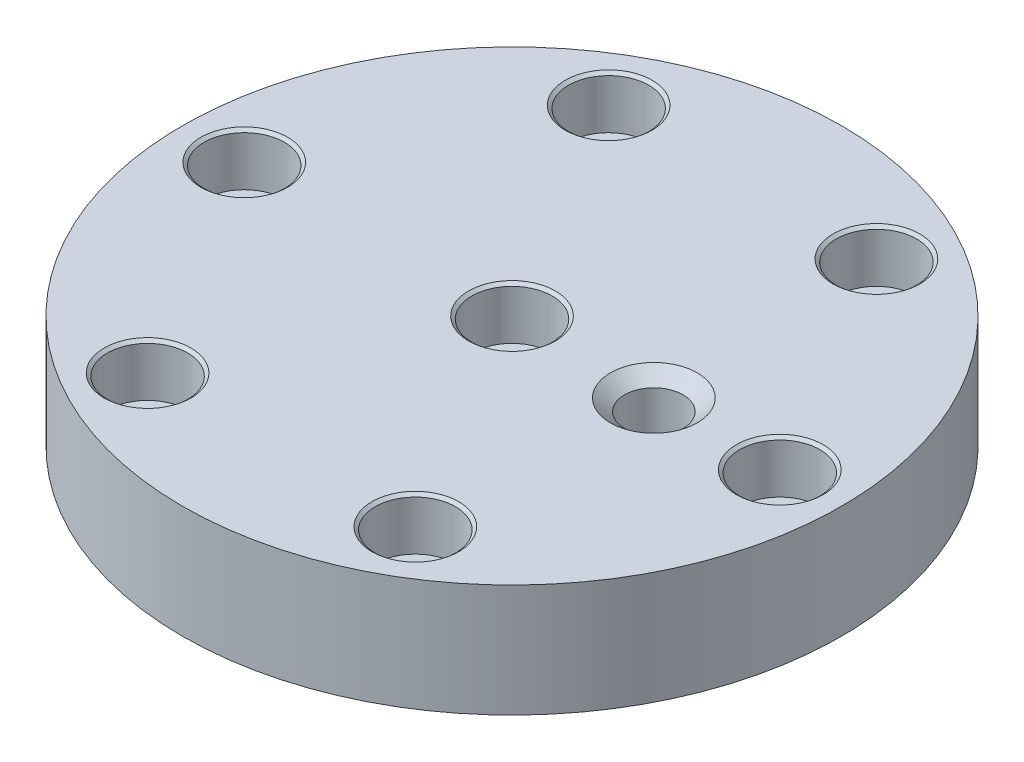
ISO-10303-21;
HEADER;
FILE_DESCRIPTION(('STEP AP214'),'2;1');
FILE_NAME('part.step','',(''),(''),'','','');
FILE_SCHEMA(('AUTOMOTIVE_DESIGN { 1 0 10303 214 1 1 1 1 }'));
ENDSEC;
DATA;
#1=APPLICATION_CONTEXT('core data for automotive mechanical design processes');
#2=APPLICATION_PROTOCOL_DEFINITION('international standard','automotive_design',2000,#1);
#3=PRODUCT_CONTEXT('',#1,'mechanical');
#4=PRODUCT('Part','Part','',(#3));
#5=PRODUCT_RELATED_PRODUCT_CATEGORY('part','',(#4));
#6=PRODUCT_DEFINITION_FORMATION('','',#4);
#7=PRODUCT_DEFINITION_CONTEXT('part definition',#1,'design');
#8=PRODUCT_DEFINITION('design','',#6,#7);
#9=PRODUCT_DEFINITION_SHAPE('','',#8);
#10=(LENGTH_UNIT() NAMED_UNIT(*) SI_UNIT(.MILLI.,.METRE.));
#11=(NAMED_UNIT(*) PLANE_ANGLE_UNIT() SI_UNIT($,.RADIAN.));
#12=(NAMED_UNIT(*) SI_UNIT($,.STERADIAN.) SOLID_ANGLE_UNIT());
#13=UNCERTAINTY_MEASURE_WITH_UNIT(LENGTH_MEASURE(1.E-05),#10,'distance_accuracy_value','');
#14=(GEOMETRIC_REPRESENTATION_CONTEXT(3) GLOBAL_UNCERTAINTY_ASSIGNED_CONTEXT((#13)) GLOBAL_UNIT_ASSIGNED_CONTEXT((#10,
#11,#12)) REPRESENTATION_CONTEXT('',''));
#15=CARTESIAN_POINT('',(0.,0.,0.));
#16=DIRECTION('',(0.,0.,1.));
#17=DIRECTION('',(1.,0.,0.));
#18=AXIS2_PLACEMENT_3D('',#15,#16,#17);
#19=CARTESIAN_POINT('',(0.,27.,0.));
#20=DIRECTION('',(0.,1.,0.));
#21=DIRECTION('',(0.,0.,1.));
#22=AXIS2_PLACEMENT_3D('',#19,#20,#21);
#23=PLANE('',#22);
#24=CARTESIAN_POINT('',(34.,27.,0.));
#25=DIRECTION('',(0.,1.,0.));
#26=DIRECTION('',(0.,0.,1.));
#27=AXIS2_PLACEMENT_3D('',#24,#25,#26);
#28=CIRCLE('',#27,10.4013);
#29=CARTESIAN_POINT('',(34.,27.,10.4013));
#30=VERTEX_POINT('',#29);
#31=EDGE_CURVE('E69',#30,#30,#28,.T.);
#32=ORIENTED_EDGE('',*,*,#31,.F.);
#33=EDGE_LOOP('',(#32));
#34=FACE_BOUND('',#33,.T.);
#35=CARTESIAN_POINT('',(31.8385743820876,27.,-55.518512059639));
#36=DIRECTION('',(0.,1.,0.));
#37=DIRECTION('',(0.,0.,1.));
#38=AXIS2_PLACEMENT_3D('',#35,#36,#37);
#39=CIRCLE('',#38,10.4013);
#40=CARTESIAN_POINT('',(31.8385743820876,27.,-45.117212059639));
#41=VERTEX_POINT('',#40);
#42=EDGE_CURVE('E60',#41,#41,#39,.T.);
#43=ORIENTED_EDGE('',*,*,#42,.F.);
#44=EDGE_LOOP('',(#43));
#45=FACE_BOUND('',#44,.T.);
#46=CARTESIAN_POINT('',(63.9997290150054,27.,-0.186241794652134));
#47=DIRECTION('',(0.,1.,0.));
#48=DIRECTION('',(0.,0.,1.));
#49=AXIS2_PLACEMENT_3D('',#46,#47,#48);
#50=CIRCLE('',#49,10.4013);
#51=CARTESIAN_POINT('',(63.9997290150054,27.,10.2150582053479));
#52=VERTEX_POINT('',#51);
#53=EDGE_CURVE('E88',#52,#52,#50,.T.);
#54=ORIENTED_EDGE('',*,*,#53,.F.);
#55=EDGE_LOOP('',(#54));
#56=FACE_BOUND('',#55,.T.);
#57=CARTESIAN_POINT('',(32.1611546329195,27.,55.3322702649877));
#58=DIRECTION('',(0.,1.,0.));
#59=DIRECTION('',(0.,0.,1.));
#60=AXIS2_PLACEMENT_3D('',#57,#58,#59);
#61=CIRCLE('',#60,10.4013);
#62=CARTESIAN_POINT('',(32.1611546329195,27.,65.7335702649877));
#63=VERTEX_POINT('',#62);
#64=EDGE_CURVE('E108',#63,#63,#61,.T.);
#65=ORIENTED_EDGE('',*,*,#64,.F.);
#66=EDGE_LOOP('',(#65));
#67=FACE_BOUND('',#66,.T.);
#68=CARTESIAN_POINT('',(-31.8385743820844,27.,55.5185120596408));
#69=DIRECTION('',(0.,1.,0.));
#70=DIRECTION('',(0.,0.,1.));
#71=AXIS2_PLACEMENT_3D('',#68,#69,#70);
#72=CIRCLE('',#71,10.4013);
#73=CARTESIAN_POINT('',(-31.8385743820844,27.,65.9198120596408));
#74=VERTEX_POINT('',#73);
#75=EDGE_CURVE('E128',#74,#74,#72,.T.);
#76=ORIENTED_EDGE('',*,*,#75,.F.);
#77=EDGE_LOOP('',(#76));
#78=FACE_BOUND('',#77,.T.);
#79=CARTESIAN_POINT('',(-63.9997290150023,27.,0.186241794653986));
#80=DIRECTION('',(0.,1.,0.));
#81=DIRECTION('',(0.,0.,1.));
#82=AXIS2_PLACEMENT_3D('',#79,#80,#81);
#83=CIRCLE('',#82,10.4013);
#84=CARTESIAN_POINT('',(-63.9997290150023,27.,10.587541794654));
#85=VERTEX_POINT('',#84);
#86=EDGE_CURVE('E148',#85,#85,#83,.T.);
#87=ORIENTED_EDGE('',*,*,#86,.F.);
#88=EDGE_LOOP('',(#87));
#89=FACE_BOUND('',#88,.T.);
#90=CARTESIAN_POINT('',(-32.1611546329163,27.,-55.3322702649859));
#91=DIRECTION('',(0.,1.,0.));
#92=DIRECTION('',(0.,0.,1.));
#93=AXIS2_PLACEMENT_3D('',#90,#91,#92);
#94=CIRCLE('',#93,10.4013);
#95=CARTESIAN_POINT('',(-32.1611546329163,27.,-44.9309702649859));
#96=VERTEX_POINT('',#95);
#97=EDGE_CURVE('E168',#96,#96,#94,.T.);
#98=ORIENTED_EDGE('',*,*,#97,.F.);
#99=EDGE_LOOP('',(#98));
#100=FACE_BOUND('',#99,.T.);
#101=CARTESIAN_POINT('',(1.59594559789866E-12,27.,9.15933995315754E-13));
#102=DIRECTION('',(0.,1.,0.));
#103=DIRECTION('',(0.,0.,1.));
#104=AXIS2_PLACEMENT_3D('',#101,#102,#103);
#105=CIRCLE('',#104,10.4013);
#106=CARTESIAN_POINT('',(1.59594559789866E-12,27.,10.4013000000009));
#107=VERTEX_POINT('',#106);
#108=EDGE_CURVE('E188',#107,#107,#105,.T.);
#109=ORIENTED_EDGE('',*,*,#108,.F.);
#110=EDGE_LOOP('',(#109));
#111=FACE_BOUND('',#110,.T.);
#112=CARTESIAN_POINT('',(0.,27.,0.));
#113=DIRECTION('',(0.,1.,0.));
#114=DIRECTION('',(0.,0.,1.));
#115=AXIS2_PLACEMENT_3D('',#112,#113,#114);
#116=CIRCLE('',#115,79.);
#117=CARTESIAN_POINT('',(0.,27.,79.));
#118=VERTEX_POINT('',#117);
#119=EDGE_CURVE('E11',#118,#118,#116,.T.);
#120=ORIENTED_EDGE('',*,*,#119,.T.);
#121=EDGE_LOOP('',(#120));
#122=FACE_BOUND('',#121,.T.);
#123=ADVANCED_FACE('F38',(#34,#45,#56,#67,#78,#89,#100,#111,#122),#23,.T.);
#124=CARTESIAN_POINT('',(0.,0.,0.));
#125=DIRECTION('',(0.,1.,0.));
#126=DIRECTION('',(0.,0.,1.));
#127=AXIS2_PLACEMENT_3D('',#124,#125,#126);
#128=PLANE('',#127);
#129=CARTESIAN_POINT('',(31.8385743820876,0.,-55.518512059639));
#130=DIRECTION('',(0.,1.,0.));
#131=DIRECTION('',(0.,0.,1.));
#132=AXIS2_PLACEMENT_3D('',#129,#130,#131);
#133=CIRCLE('',#132,6.24999994599999);
#134=CARTESIAN_POINT('',(31.8385743820876,0.,-49.268512113639));
#135=VERTEX_POINT('',#134);
#136=EDGE_CURVE('E84',#135,#135,#133,.T.);
#137=ORIENTED_EDGE('',*,*,#136,.T.);
#138=EDGE_LOOP('',(#137));
#139=FACE_BOUND('',#138,.T.);
#140=CARTESIAN_POINT('',(63.9997290150054,0.,-0.186241794652134));
#141=DIRECTION('',(0.,1.,0.));
#142=DIRECTION('',(0.,0.,1.));
#143=AXIS2_PLACEMENT_3D('',#140,#141,#142);
#144=CIRCLE('',#143,6.24999994599999);
#145=CARTESIAN_POINT('',(63.9997290150054,0.,6.06375815134786));
#146=VERTEX_POINT('',#145);
#147=EDGE_CURVE('E104',#146,#146,#144,.T.);
#148=ORIENTED_EDGE('',*,*,#147,.T.);
#149=EDGE_LOOP('',(#148));
#150=FACE_BOUND('',#149,.T.);
#151=CARTESIAN_POINT('',(32.1611546329195,0.,55.3322702649877));
#152=DIRECTION('',(0.,1.,0.));
#153=DIRECTION('',(0.,0.,1.));
#154=AXIS2_PLACEMENT_3D('',#151,#152,#153);
#155=CIRCLE('',#154,6.24999994599999);
#156=CARTESIAN_POINT('',(32.1611546329195,0.,61.5822702109877));
#157=VERTEX_POINT('',#156);
#158=EDGE_CURVE('E124',#157,#157,#155,.T.);
#159=ORIENTED_EDGE('',*,*,#158,.T.);
#160=EDGE_LOOP('',(#159));
#161=FACE_BOUND('',#160,.T.);
#162=CARTESIAN_POINT('',(-31.8385743820844,0.,55.5185120596408));
#163=DIRECTION('',(0.,1.,0.));
#164=DIRECTION('',(0.,0.,1.));
#165=AXIS2_PLACEMENT_3D('',#162,#163,#164);
#166=CIRCLE('',#165,6.24999994599999);
#167=CARTESIAN_POINT('',(-31.8385743820844,0.,61.7685120056408));
#168=VERTEX_POINT('',#167);
#169=EDGE_CURVE('E144',#168,#168,#166,.T.);
#170=ORIENTED_EDGE('',*,*,#169,.T.);
#171=EDGE_LOOP('',(#170));
#172=FACE_BOUND('',#171,.T.);
#173=CARTESIAN_POINT('',(-63.9997290150023,0.,0.186241794653986));
#174=DIRECTION('',(0.,1.,0.));
#175=DIRECTION('',(0.,0.,1.));
#176=AXIS2_PLACEMENT_3D('',#173,#174,#175);
#177=CIRCLE('',#176,6.24999994599999);
#178=CARTESIAN_POINT('',(-63.9997290150023,0.,6.43624174065398));
#179=VERTEX_POINT('',#178);
#180=EDGE_CURVE('E164',#179,#179,#177,.T.);
#181=ORIENTED_EDGE('',*,*,#180,.T.);
#182=EDGE_LOOP('',(#181));
#183=FACE_BOUND('',#182,.T.);
#184=CARTESIAN_POINT('',(-32.1611546329163,0.,-55.3322702649859));
#185=DIRECTION('',(0.,1.,0.));
#186=DIRECTION('',(0.,0.,1.));
#187=AXIS2_PLACEMENT_3D('',#184,#185,#186);
#188=CIRCLE('',#187,6.24999994599999);
#189=CARTESIAN_POINT('',(-32.1611546329163,0.,-49.0822703189859));
#190=VERTEX_POINT('',#189);
#191=EDGE_CURVE('E184',#190,#190,#188,.T.);
#192=ORIENTED_EDGE('',*,*,#191,.T.);
#193=EDGE_LOOP('',(#192));
#194=FACE_BOUND('',#193,.T.);
#195=CARTESIAN_POINT('',(1.59594559789866E-12,0.,9.15933995315754E-13));
#196=DIRECTION('',(0.,1.,0.));
#197=DIRECTION('',(0.,0.,1.));
#198=AXIS2_PLACEMENT_3D('',#195,#196,#197);
#199=CIRCLE('',#198,6.24999994599999);
#200=CARTESIAN_POINT('',(1.59594559789866E-12,0.,6.24999994600091));
#201=VERTEX_POINT('',#200);
#202=EDGE_CURVE('E204',#201,#201,#199,.T.);
#203=ORIENTED_EDGE('',*,*,#202,.T.);
#204=EDGE_LOOP('',(#203));
#205=FACE_BOUND('',#204,.T.);
#206=CARTESIAN_POINT('',(0.,0.,0.));
#207=DIRECTION('',(0.,1.,0.));
#208=DIRECTION('',(0.,0.,1.));
#209=AXIS2_PLACEMENT_3D('',#206,#207,#208);
#210=CIRCLE('',#209,79.);
#211=CARTESIAN_POINT('',(0.,0.,79.));
#212=VERTEX_POINT('',#211);
#213=EDGE_CURVE('E42',#212,#212,#210,.T.);
#214=ORIENTED_EDGE('',*,*,#213,.F.);
#215=EDGE_LOOP('',(#214));
#216=FACE_BOUND('',#215,.T.);
#217=ADVANCED_FACE('F214',(#139,#150,#161,#172,#183,#194,#205,#216),#128,.F.);
#218=CARTESIAN_POINT('',(0.,27.,0.));
#219=DIRECTION('',(0.,-1.,0.));
#220=DIRECTION('',(0.,0.,-1.));
#221=AXIS2_PLACEMENT_3D('',#218,#219,#220);
#222=CYLINDRICAL_SURFACE('',#221,79.);
#223=ORIENTED_EDGE('',*,*,#119,.F.);
#224=EDGE_LOOP('',(#223));
#225=FACE_BOUND('',#224,.T.);
#226=ORIENTED_EDGE('',*,*,#213,.T.);
#227=EDGE_LOOP('',(#226));
#228=FACE_BOUND('',#227,.T.);
#229=ADVANCED_FACE('F40',(#225,#228),#222,.T.);
#230=CARTESIAN_POINT('',(1.59594559789866E-12,27.,9.15933995315754E-13));
#231=DIRECTION('',(0.,1.,0.));
#232=DIRECTION('',(0.,0.,1.));
#233=AXIS2_PLACEMENT_3D('',#230,#231,#232);
#234=CYLINDRICAL_SURFACE('',#233,6.24999994599999);
#235=ORIENTED_EDGE('',*,*,#202,.F.);
#236=EDGE_LOOP('',(#235));
#237=FACE_BOUND('',#236,.T.);
#238=CARTESIAN_POINT('',(1.59594559789866E-12,14.500000108,9.15933995315754E-13));
#239=DIRECTION('',(0.,1.,0.));
#240=DIRECTION('',(0.,0.,1.));
#241=AXIS2_PLACEMENT_3D('',#238,#239,#240);
#242=CIRCLE('',#241,6.249999946);
#243=CARTESIAN_POINT('',(1.59594559789866E-12,14.500000108,6.24999994600091));
#244=VERTEX_POINT('',#243);
#245=EDGE_CURVE('E200',#244,#244,#242,.T.);
#246=ORIENTED_EDGE('',*,*,#245,.T.);
#247=EDGE_LOOP('',(#246));
#248=FACE_BOUND('',#247,.T.);
#249=ADVANCED_FACE('F221',(#237,#248),#234,.F.);
#250=CARTESIAN_POINT('',(9.62500005400159,14.500000108,9.15933995315754E-13));
#251=DIRECTION('',(0.,-1.,0.));
#252=DIRECTION('',(0.,0.,-1.));
#253=AXIS2_PLACEMENT_3D('',#250,#251,#252);
#254=PLANE('',#253);
#255=ORIENTED_EDGE('',*,*,#245,.F.);
#256=EDGE_LOOP('',(#255));
#257=FACE_BOUND('',#256,.T.);
#258=CARTESIAN_POINT('',(1.59594559789866E-12,14.500000108,9.15933995315754E-13));
#259=DIRECTION('',(0.,1.,0.));
#260=DIRECTION('',(0.,0.,1.));
#261=AXIS2_PLACEMENT_3D('',#258,#259,#260);
#262=CIRCLE('',#261,9.625000054);
#263=CARTESIAN_POINT('',(1.59594559789866E-12,14.500000108,9.62500005400091));
#264=VERTEX_POINT('',#263);
#265=EDGE_CURVE('E196',#264,#264,#262,.T.);
#266=ORIENTED_EDGE('',*,*,#265,.T.);
#267=EDGE_LOOP('',(#266));
#268=FACE_BOUND('',#267,.T.);
#269=ADVANCED_FACE('F229',(#257,#268),#254,.F.);
#270=CARTESIAN_POINT('',(1.59594559789866E-12,27.,9.15933995315754E-13));
#271=DIRECTION('',(0.,1.,0.));
#272=DIRECTION('',(0.,0.,1.));
#273=AXIS2_PLACEMENT_3D('',#270,#271,#272);
#274=CYLINDRICAL_SURFACE('',#273,9.625000054);
#275=ORIENTED_EDGE('',*,*,#265,.F.);
#276=EDGE_LOOP('',(#275));
#277=FACE_BOUND('',#276,.T.);
#278=CARTESIAN_POINT('',(1.59594559789866E-12,26.3486070016285,9.15933995315754E-13));
#279=DIRECTION('',(0.,1.,0.));
#280=DIRECTION('',(0.,0.,1.));
#281=AXIS2_PLACEMENT_3D('',#278,#279,#280);
#282=CIRCLE('',#281,9.625000054);
#283=CARTESIAN_POINT('',(1.59594559789866E-12,26.3486070016285,9.62500005400091));
#284=VERTEX_POINT('',#283);
#285=EDGE_CURVE('E192',#284,#284,#282,.T.);
#286=ORIENTED_EDGE('',*,*,#285,.T.);
#287=EDGE_LOOP('',(#286));
#288=FACE_BOUND('',#287,.T.);
#289=ADVANCED_FACE('F233',(#277,#288),#274,.F.);
#290=CARTESIAN_POINT('',(1.59594559789866E-12,27.,9.15933995315754E-13));
#291=DIRECTION('',(0.,1.,0.));
#292=DIRECTION('',(0.,0.,1.));
#293=AXIS2_PLACEMENT_3D('',#290,#291,#292);
#294=CONICAL_SURFACE('',#293,10.4013,0.872664625997165);
#295=ORIENTED_EDGE('',*,*,#285,.F.);
#296=EDGE_LOOP('',(#295));
#297=FACE_BOUND('',#296,.T.);
#298=ORIENTED_EDGE('',*,*,#108,.T.);
#299=EDGE_LOOP('',(#298));
#300=FACE_BOUND('',#299,.T.);
#301=ADVANCED_FACE('F237',(#297,#300),#294,.F.);
#302=CARTESIAN_POINT('',(-32.1611546329163,27.,-55.3322702649859));
#303=DIRECTION('',(0.,1.,0.));
#304=DIRECTION('',(0.,0.,1.));
#305=AXIS2_PLACEMENT_3D('',#302,#303,#304);
#306=CYLINDRICAL_SURFACE('',#305,6.24999994599999);
#307=ORIENTED_EDGE('',*,*,#191,.F.);
#308=EDGE_LOOP('',(#307));
#309=FACE_BOUND('',#308,.T.);
#310=CARTESIAN_POINT('',(-32.1611546329163,14.500000108,-55.3322702649859));
#311=DIRECTION('',(0.,1.,0.));
#312=DIRECTION('',(0.,0.,1.));
#313=AXIS2_PLACEMENT_3D('',#310,#311,#312);
#314=CIRCLE('',#313,6.249999946);
#315=CARTESIAN_POINT('',(-32.1611546329163,14.500000108,-49.0822703189859));
#316=VERTEX_POINT('',#315);
#317=EDGE_CURVE('E180',#316,#316,#314,.T.);
#318=ORIENTED_EDGE('',*,*,#317,.T.);
#319=EDGE_LOOP('',(#318));
#320=FACE_BOUND('',#319,.T.);
#321=ADVANCED_FACE('F241',(#309,#320),#306,.F.);
#322=CARTESIAN_POINT('',(-22.5361545789163,14.500000108,-55.3322702649859));
#323=DIRECTION('',(0.,-1.,0.));
#324=DIRECTION('',(0.,0.,-1.));
#325=AXIS2_PLACEMENT_3D('',#322,#323,#324);
#326=PLANE('',#325);
#327=ORIENTED_EDGE('',*,*,#317,.F.);
#328=EDGE_LOOP('',(#327));
#329=FACE_BOUND('',#328,.T.);
#330=CARTESIAN_POINT('',(-32.1611546329163,14.500000108,-55.3322702649859));
#331=DIRECTION('',(0.,1.,0.));
#332=DIRECTION('',(0.,0.,1.));
#333=AXIS2_PLACEMENT_3D('',#330,#331,#332);
#334=CIRCLE('',#333,9.62500005399999);
#335=CARTESIAN_POINT('',(-32.1611546329163,14.500000108,-45.7072702109859));
#336=VERTEX_POINT('',#335);
#337=EDGE_CURVE('E176',#336,#336,#334,.T.);
#338=ORIENTED_EDGE('',*,*,#337,.T.);
#339=EDGE_LOOP('',(#338));
#340=FACE_BOUND('',#339,.T.);
#341=ADVANCED_FACE('F245',(#329,#340),#326,.F.);
#342=CARTESIAN_POINT('',(-32.1611546329163,27.,-55.3322702649859));
#343=DIRECTION('',(0.,1.,0.));
#344=DIRECTION('',(0.,0.,1.));
#345=AXIS2_PLACEMENT_3D('',#342,#343,#344);
#346=CYLINDRICAL_SURFACE('',#345,9.625000054);
#347=ORIENTED_EDGE('',*,*,#337,.F.);
#348=EDGE_LOOP('',(#347));
#349=FACE_BOUND('',#348,.T.);
#350=CARTESIAN_POINT('',(-32.1611546329163,26.3486070016285,-55.3322702649859));
#351=DIRECTION('',(0.,1.,0.));
#352=DIRECTION('',(0.,0.,1.));
#353=AXIS2_PLACEMENT_3D('',#350,#351,#352);
#354=CIRCLE('',#353,9.625000054);
#355=CARTESIAN_POINT('',(-32.1611546329163,26.3486070016285,-45.7072702109859));
#356=VERTEX_POINT('',#355);
#357=EDGE_CURVE('E172',#356,#356,#354,.T.);
#358=ORIENTED_EDGE('',*,*,#357,.T.);
#359=EDGE_LOOP('',(#358));
#360=FACE_BOUND('',#359,.T.);
#361=ADVANCED_FACE('F249',(#349,#360),#346,.F.);
#362=CARTESIAN_POINT('',(-32.1611546329163,27.,-55.3322702649859));
#363=DIRECTION('',(0.,1.,0.));
#364=DIRECTION('',(0.,0.,1.));
#365=AXIS2_PLACEMENT_3D('',#362,#363,#364);
#366=CONICAL_SURFACE('',#365,10.4013,0.872664625997164);
#367=ORIENTED_EDGE('',*,*,#357,.F.);
#368=EDGE_LOOP('',(#367));
#369=FACE_BOUND('',#368,.T.);
#370=ORIENTED_EDGE('',*,*,#97,.T.);
#371=EDGE_LOOP('',(#370));
#372=FACE_BOUND('',#371,.T.);
#373=ADVANCED_FACE('F253',(#369,#372),#366,.F.);
#374=CARTESIAN_POINT('',(-63.9997290150023,27.,0.186241794653986));
#375=DIRECTION('',(0.,1.,0.));
#376=DIRECTION('',(0.,0.,1.));
#377=AXIS2_PLACEMENT_3D('',#374,#375,#376);
#378=CYLINDRICAL_SURFACE('',#377,6.24999994599999);
#379=ORIENTED_EDGE('',*,*,#180,.F.);
#380=EDGE_LOOP('',(#379));
#381=FACE_BOUND('',#380,.T.);
#382=CARTESIAN_POINT('',(-63.9997290150023,14.500000108,0.186241794653986));
#383=DIRECTION('',(0.,1.,0.));
#384=DIRECTION('',(0.,0.,1.));
#385=AXIS2_PLACEMENT_3D('',#382,#383,#384);
#386=CIRCLE('',#385,6.24999994599999);
#387=CARTESIAN_POINT('',(-63.9997290150023,14.500000108,6.43624174065398));
#388=VERTEX_POINT('',#387);
#389=EDGE_CURVE('E160',#388,#388,#386,.T.);
#390=ORIENTED_EDGE('',*,*,#389,.T.);
#391=EDGE_LOOP('',(#390));
#392=FACE_BOUND('',#391,.T.);
#393=ADVANCED_FACE('F257',(#381,#392),#378,.F.);
#394=CARTESIAN_POINT('',(-54.3747289610023,14.500000108,0.186241794653986));
#395=DIRECTION('',(0.,-1.,0.));
#396=DIRECTION('',(0.,0.,-1.));
#397=AXIS2_PLACEMENT_3D('',#394,#395,#396);
#398=PLANE('',#397);
#399=ORIENTED_EDGE('',*,*,#389,.F.);
#400=EDGE_LOOP('',(#399));
#401=FACE_BOUND('',#400,.T.);
#402=CARTESIAN_POINT('',(-63.9997290150023,14.500000108,0.186241794653986));
#403=DIRECTION('',(0.,1.,0.));
#404=DIRECTION('',(0.,0.,1.));
#405=AXIS2_PLACEMENT_3D('',#402,#403,#404);
#406=CIRCLE('',#405,9.62500005399999);
#407=CARTESIAN_POINT('',(-63.9997290150023,14.500000108,9.81124184865398));
#408=VERTEX_POINT('',#407);
#409=EDGE_CURVE('E156',#408,#408,#406,.T.);
#410=ORIENTED_EDGE('',*,*,#409,.T.);
#411=EDGE_LOOP('',(#410));
#412=FACE_BOUND('',#411,.T.);
#413=ADVANCED_FACE('F261',(#401,#412),#398,.F.);
#414=CARTESIAN_POINT('',(-63.9997290150023,27.,0.186241794653986));
#415=DIRECTION('',(0.,1.,0.));
#416=DIRECTION('',(0.,0.,1.));
#417=AXIS2_PLACEMENT_3D('',#414,#415,#416);
#418=CYLINDRICAL_SURFACE('',#417,9.625000054);
#419=ORIENTED_EDGE('',*,*,#409,.F.);
#420=EDGE_LOOP('',(#419));
#421=FACE_BOUND('',#420,.T.);
#422=CARTESIAN_POINT('',(-63.9997290150023,26.3486070016285,0.186241794653986));
#423=DIRECTION('',(0.,1.,0.));
#424=DIRECTION('',(0.,0.,1.));
#425=AXIS2_PLACEMENT_3D('',#422,#423,#424);
#426=CIRCLE('',#425,9.625000054);
#427=CARTESIAN_POINT('',(-63.9997290150023,26.3486070016285,9.81124184865399));
#428=VERTEX_POINT('',#427);
#429=EDGE_CURVE('E152',#428,#428,#426,.T.);
#430=ORIENTED_EDGE('',*,*,#429,.T.);
#431=EDGE_LOOP('',(#430));
#432=FACE_BOUND('',#431,.T.);
#433=ADVANCED_FACE('F265',(#421,#432),#418,.F.);
#434=CARTESIAN_POINT('',(-63.9997290150023,27.,0.186241794653986));
#435=DIRECTION('',(0.,1.,0.));
#436=DIRECTION('',(0.,0.,1.));
#437=AXIS2_PLACEMENT_3D('',#434,#435,#436);
#438=CONICAL_SURFACE('',#437,10.4013,0.872664625997166);
#439=ORIENTED_EDGE('',*,*,#429,.F.);
#440=EDGE_LOOP('',(#439));
#441=FACE_BOUND('',#440,.T.);
#442=ORIENTED_EDGE('',*,*,#86,.T.);
#443=EDGE_LOOP('',(#442));
#444=FACE_BOUND('',#443,.T.);
#445=ADVANCED_FACE('F269',(#441,#444),#438,.F.);
#446=CARTESIAN_POINT('',(-31.8385743820844,27.,55.5185120596408));
#447=DIRECTION('',(0.,1.,0.));
#448=DIRECTION('',(0.,0.,1.));
#449=AXIS2_PLACEMENT_3D('',#446,#447,#448);
#450=CYLINDRICAL_SURFACE('',#449,6.24999994599999);
#451=ORIENTED_EDGE('',*,*,#169,.F.);
#452=EDGE_LOOP('',(#451));
#453=FACE_BOUND('',#452,.T.);
#454=CARTESIAN_POINT('',(-31.8385743820844,14.500000108,55.5185120596408));
#455=DIRECTION('',(0.,1.,0.));
#456=DIRECTION('',(0.,0.,1.));
#457=AXIS2_PLACEMENT_3D('',#454,#455,#456);
#458=CIRCLE('',#457,6.249999946);
#459=CARTESIAN_POINT('',(-31.8385743820844,14.500000108,61.7685120056408));
#460=VERTEX_POINT('',#459);
#461=EDGE_CURVE('E140',#460,#460,#458,.T.);
#462=ORIENTED_EDGE('',*,*,#461,.T.);
#463=EDGE_LOOP('',(#462));
#464=FACE_BOUND('',#463,.T.);
#465=ADVANCED_FACE('F273',(#453,#464),#450,.F.);
#466=CARTESIAN_POINT('',(-22.2135743280844,14.500000108,55.5185120596408));
#467=DIRECTION('',(0.,-1.,0.));
#468=DIRECTION('',(0.,0.,-1.));
#469=AXIS2_PLACEMENT_3D('',#466,#467,#468);
#470=PLANE('',#469);
#471=ORIENTED_EDGE('',*,*,#461,.F.);
#472=EDGE_LOOP('',(#471));
#473=FACE_BOUND('',#472,.T.);
#474=CARTESIAN_POINT('',(-31.8385743820844,14.500000108,55.5185120596408));
#475=DIRECTION('',(0.,1.,0.));
#476=DIRECTION('',(0.,0.,1.));
#477=AXIS2_PLACEMENT_3D('',#474,#475,#476);
#478=CIRCLE('',#477,9.62500005399999);
#479=CARTESIAN_POINT('',(-31.8385743820844,14.500000108,65.1435121136408));
#480=VERTEX_POINT('',#479);
#481=EDGE_CURVE('E136',#480,#480,#478,.T.);
#482=ORIENTED_EDGE('',*,*,#481,.T.);
#483=EDGE_LOOP('',(#482));
#484=FACE_BOUND('',#483,.T.);
#485=ADVANCED_FACE('F277',(#473,#484),#470,.F.);
#486=CARTESIAN_POINT('',(-31.8385743820844,27.,55.5185120596408));
#487=DIRECTION('',(0.,1.,0.));
#488=DIRECTION('',(0.,0.,1.));
#489=AXIS2_PLACEMENT_3D('',#486,#487,#488);
#490=CYLINDRICAL_SURFACE('',#489,9.625000054);
#491=ORIENTED_EDGE('',*,*,#481,.F.);
#492=EDGE_LOOP('',(#491));
#493=FACE_BOUND('',#492,.T.);
#494=CARTESIAN_POINT('',(-31.8385743820844,26.3486070016285,55.5185120596408));
#495=DIRECTION('',(0.,1.,0.));
#496=DIRECTION('',(0.,0.,1.));
#497=AXIS2_PLACEMENT_3D('',#494,#495,#496);
#498=CIRCLE('',#497,9.625000054);
#499=CARTESIAN_POINT('',(-31.8385743820844,26.3486070016285,65.1435121136408));
#500=VERTEX_POINT('',#499);
#501=EDGE_CURVE('E132',#500,#500,#498,.T.);
#502=ORIENTED_EDGE('',*,*,#501,.T.);
#503=EDGE_LOOP('',(#502));
#504=FACE_BOUND('',#503,.T.);
#505=ADVANCED_FACE('F281',(#493,#504),#490,.F.);
#506=CARTESIAN_POINT('',(-31.8385743820844,27.,55.5185120596408));
#507=DIRECTION('',(0.,1.,0.));
#508=DIRECTION('',(0.,0.,1.));
#509=AXIS2_PLACEMENT_3D('',#506,#507,#508);
#510=CONICAL_SURFACE('',#509,10.4013,0.872664625997164);
#511=ORIENTED_EDGE('',*,*,#501,.F.);
#512=EDGE_LOOP('',(#511));
#513=FACE_BOUND('',#512,.T.);
#514=ORIENTED_EDGE('',*,*,#75,.T.);
#515=EDGE_LOOP('',(#514));
#516=FACE_BOUND('',#515,.T.);
#517=ADVANCED_FACE('F285',(#513,#516),#510,.F.);
#518=CARTESIAN_POINT('',(32.1611546329195,27.,55.3322702649877));
#519=DIRECTION('',(0.,1.,0.));
#520=DIRECTION('',(0.,0.,1.));
#521=AXIS2_PLACEMENT_3D('',#518,#519,#520);
#522=CYLINDRICAL_SURFACE('',#521,6.249999946);
#523=ORIENTED_EDGE('',*,*,#158,.F.);
#524=EDGE_LOOP('',(#523));
#525=FACE_BOUND('',#524,.T.);
#526=CARTESIAN_POINT('',(32.1611546329195,14.500000108,55.3322702649877));
#527=DIRECTION('',(0.,1.,0.));
#528=DIRECTION('',(0.,0.,1.));
#529=AXIS2_PLACEMENT_3D('',#526,#527,#528);
#530=CIRCLE('',#529,6.249999946);
#531=CARTESIAN_POINT('',(32.1611546329195,14.500000108,61.5822702109878));
#532=VERTEX_POINT('',#531);
#533=EDGE_CURVE('E120',#532,#532,#530,.T.);
#534=ORIENTED_EDGE('',*,*,#533,.T.);
#535=EDGE_LOOP('',(#534));
#536=FACE_BOUND('',#535,.T.);
#537=ADVANCED_FACE('F289',(#525,#536),#522,.F.);
#538=CARTESIAN_POINT('',(41.7861546869195,14.500000108,55.3322702649877));
#539=DIRECTION('',(0.,-1.,0.));
#540=DIRECTION('',(0.,0.,-1.));
#541=AXIS2_PLACEMENT_3D('',#538,#539,#540);
#542=PLANE('',#541);
#543=ORIENTED_EDGE('',*,*,#533,.F.);
#544=EDGE_LOOP('',(#543));
#545=FACE_BOUND('',#544,.T.);
#546=CARTESIAN_POINT('',(32.1611546329195,14.500000108,55.3322702649877));
#547=DIRECTION('',(0.,1.,0.));
#548=DIRECTION('',(0.,0.,1.));
#549=AXIS2_PLACEMENT_3D('',#546,#547,#548);
#550=CIRCLE('',#549,9.62500005399999);
#551=CARTESIAN_POINT('',(32.1611546329195,14.500000108,64.9572703189877));
#552=VERTEX_POINT('',#551);
#553=EDGE_CURVE('E116',#552,#552,#550,.T.);
#554=ORIENTED_EDGE('',*,*,#553,.T.);
#555=EDGE_LOOP('',(#554));
#556=FACE_BOUND('',#555,.T.);
#557=ADVANCED_FACE('F293',(#545,#556),#542,.F.);
#558=CARTESIAN_POINT('',(32.1611546329195,27.,55.3322702649877));
#559=DIRECTION('',(0.,1.,0.));
#560=DIRECTION('',(0.,0.,1.));
#561=AXIS2_PLACEMENT_3D('',#558,#559,#560);
#562=CYLINDRICAL_SURFACE('',#561,9.625000054);
#563=ORIENTED_EDGE('',*,*,#553,.F.);
#564=EDGE_LOOP('',(#563));
#565=FACE_BOUND('',#564,.T.);
#566=CARTESIAN_POINT('',(32.1611546329195,26.3486070016285,55.3322702649877));
#567=DIRECTION('',(0.,1.,0.));
#568=DIRECTION('',(0.,0.,1.));
#569=AXIS2_PLACEMENT_3D('',#566,#567,#568);
#570=CIRCLE('',#569,9.625000054);
#571=CARTESIAN_POINT('',(32.1611546329195,26.3486070016285,64.9572703189878));
#572=VERTEX_POINT('',#571);
#573=EDGE_CURVE('E112',#572,#572,#570,.T.);
#574=ORIENTED_EDGE('',*,*,#573,.T.);
#575=EDGE_LOOP('',(#574));
#576=FACE_BOUND('',#575,.T.);
#577=ADVANCED_FACE('F297',(#565,#576),#562,.F.);
#578=CARTESIAN_POINT('',(32.1611546329195,27.,55.3322702649877));
#579=DIRECTION('',(0.,1.,0.));
#580=DIRECTION('',(0.,0.,1.));
#581=AXIS2_PLACEMENT_3D('',#578,#579,#580);
#582=CONICAL_SURFACE('',#581,10.4013,0.872664625997162);
#583=ORIENTED_EDGE('',*,*,#573,.F.);
#584=EDGE_LOOP('',(#583));
#585=FACE_BOUND('',#584,.T.);
#586=ORIENTED_EDGE('',*,*,#64,.T.);
#587=EDGE_LOOP('',(#586));
#588=FACE_BOUND('',#587,.T.);
#589=ADVANCED_FACE('F301',(#585,#588),#582,.F.);
#590=CARTESIAN_POINT('',(63.9997290150054,27.,-0.186241794652134));
#591=DIRECTION('',(0.,1.,0.));
#592=DIRECTION('',(0.,0.,1.));
#593=AXIS2_PLACEMENT_3D('',#590,#591,#592);
#594=CYLINDRICAL_SURFACE('',#593,6.24999994599999);
#595=ORIENTED_EDGE('',*,*,#147,.F.);
#596=EDGE_LOOP('',(#595));
#597=FACE_BOUND('',#596,.T.);
#598=CARTESIAN_POINT('',(63.9997290150054,14.500000108,-0.186241794652134));
#599=DIRECTION('',(0.,1.,0.));
#600=DIRECTION('',(0.,0.,1.));
#601=AXIS2_PLACEMENT_3D('',#598,#599,#600);
#602=CIRCLE('',#601,6.24999994599999);
#603=CARTESIAN_POINT('',(63.9997290150054,14.500000108,6.06375815134786));
#604=VERTEX_POINT('',#603);
#605=EDGE_CURVE('E100',#604,#604,#602,.T.);
#606=ORIENTED_EDGE('',*,*,#605,.T.);
#607=EDGE_LOOP('',(#606));
#608=FACE_BOUND('',#607,.T.);
#609=ADVANCED_FACE('F305',(#597,#608),#594,.F.);
#610=CARTESIAN_POINT('',(73.6247290690054,14.500000108,-0.186241794652134));
#611=DIRECTION('',(0.,-1.,0.));
#612=DIRECTION('',(0.,0.,-1.));
#613=AXIS2_PLACEMENT_3D('',#610,#611,#612);
#614=PLANE('',#613);
#615=ORIENTED_EDGE('',*,*,#605,.F.);
#616=EDGE_LOOP('',(#615));
#617=FACE_BOUND('',#616,.T.);
#618=CARTESIAN_POINT('',(63.9997290150054,14.500000108,-0.186241794652134));
#619=DIRECTION('',(0.,1.,0.));
#620=DIRECTION('',(0.,0.,1.));
#621=AXIS2_PLACEMENT_3D('',#618,#619,#620);
#622=CIRCLE('',#621,9.62500005399999);
#623=CARTESIAN_POINT('',(63.9997290150054,14.500000108,9.43875825934786));
#624=VERTEX_POINT('',#623);
#625=EDGE_CURVE('E96',#624,#624,#622,.T.);
#626=ORIENTED_EDGE('',*,*,#625,.T.);
#627=EDGE_LOOP('',(#626));
#628=FACE_BOUND('',#627,.T.);
#629=ADVANCED_FACE('F309',(#617,#628),#614,.F.);
#630=CARTESIAN_POINT('',(63.9997290150054,27.,-0.186241794652134));
#631=DIRECTION('',(0.,1.,0.));
#632=DIRECTION('',(0.,0.,1.));
#633=AXIS2_PLACEMENT_3D('',#630,#631,#632);
#634=CYLINDRICAL_SURFACE('',#633,9.62500005399999);
#635=ORIENTED_EDGE('',*,*,#625,.F.);
#636=EDGE_LOOP('',(#635));
#637=FACE_BOUND('',#636,.T.);
#638=CARTESIAN_POINT('',(63.9997290150054,26.3486070016285,-0.186241794652134));
#639=DIRECTION('',(0.,1.,0.));
#640=DIRECTION('',(0.,0.,1.));
#641=AXIS2_PLACEMENT_3D('',#638,#639,#640);
#642=CIRCLE('',#641,9.62500005399999);
#643=CARTESIAN_POINT('',(63.9997290150054,26.3486070016285,9.43875825934786));
#644=VERTEX_POINT('',#643);
#645=EDGE_CURVE('E92',#644,#644,#642,.T.);
#646=ORIENTED_EDGE('',*,*,#645,.T.);
#647=EDGE_LOOP('',(#646));
#648=FACE_BOUND('',#647,.T.);
#649=ADVANCED_FACE('F313',(#637,#648),#634,.F.);
#650=CARTESIAN_POINT('',(63.9997290150054,27.,-0.186241794652134));
#651=DIRECTION('',(0.,1.,0.));
#652=DIRECTION('',(0.,0.,1.));
#653=AXIS2_PLACEMENT_3D('',#650,#651,#652);
#654=CONICAL_SURFACE('',#653,10.4013,0.87266462599717);
#655=ORIENTED_EDGE('',*,*,#645,.F.);
#656=EDGE_LOOP('',(#655));
#657=FACE_BOUND('',#656,.T.);
#658=ORIENTED_EDGE('',*,*,#53,.T.);
#659=EDGE_LOOP('',(#658));
#660=FACE_BOUND('',#659,.T.);
#661=ADVANCED_FACE('F317',(#657,#660),#654,.F.);
#662=CARTESIAN_POINT('',(31.8385743820876,27.,-55.518512059639));
#663=DIRECTION('',(0.,1.,0.));
#664=DIRECTION('',(0.,0.,1.));
#665=AXIS2_PLACEMENT_3D('',#662,#663,#664);
#666=CYLINDRICAL_SURFACE('',#665,6.24999994599999);
#667=ORIENTED_EDGE('',*,*,#136,.F.);
#668=EDGE_LOOP('',(#667));
#669=FACE_BOUND('',#668,.T.);
#670=CARTESIAN_POINT('',(31.8385743820876,14.500000108,-55.518512059639));
#671=DIRECTION('',(0.,1.,0.));
#672=DIRECTION('',(0.,0.,1.));
#673=AXIS2_PLACEMENT_3D('',#670,#671,#672);
#674=CIRCLE('',#673,6.24999994599999);
#675=CARTESIAN_POINT('',(31.8385743820876,14.500000108,-49.268512113639));
#676=VERTEX_POINT('',#675);
#677=EDGE_CURVE('E80',#676,#676,#674,.T.);
#678=ORIENTED_EDGE('',*,*,#677,.T.);
#679=EDGE_LOOP('',(#678));
#680=FACE_BOUND('',#679,.T.);
#681=ADVANCED_FACE('F321',(#669,#680),#666,.F.);
#682=CARTESIAN_POINT('',(41.4635744360876,14.500000108,-55.518512059639));
#683=DIRECTION('',(0.,-1.,0.));
#684=DIRECTION('',(0.,0.,-1.));
#685=AXIS2_PLACEMENT_3D('',#682,#683,#684);
#686=PLANE('',#685);
#687=ORIENTED_EDGE('',*,*,#677,.F.);
#688=EDGE_LOOP('',(#687));
#689=FACE_BOUND('',#688,.T.);
#690=CARTESIAN_POINT('',(31.8385743820876,14.500000108,-55.518512059639));
#691=DIRECTION('',(0.,1.,0.));
#692=DIRECTION('',(0.,0.,1.));
#693=AXIS2_PLACEMENT_3D('',#690,#691,#692);
#694=CIRCLE('',#693,9.62500005399999);
#695=CARTESIAN_POINT('',(31.8385743820876,14.500000108,-45.893512005639));
#696=VERTEX_POINT('',#695);
#697=EDGE_CURVE('E76',#696,#696,#694,.T.);
#698=ORIENTED_EDGE('',*,*,#697,.T.);
#699=EDGE_LOOP('',(#698));
#700=FACE_BOUND('',#699,.T.);
#701=ADVANCED_FACE('F325',(#689,#700),#686,.F.);
#702=CARTESIAN_POINT('',(31.8385743820876,27.,-55.518512059639));
#703=DIRECTION('',(0.,1.,0.));
#704=DIRECTION('',(0.,0.,1.));
#705=AXIS2_PLACEMENT_3D('',#702,#703,#704);
#706=CYLINDRICAL_SURFACE('',#705,9.625000054);
#707=ORIENTED_EDGE('',*,*,#697,.F.);
#708=EDGE_LOOP('',(#707));
#709=FACE_BOUND('',#708,.T.);
#710=CARTESIAN_POINT('',(31.8385743820876,26.3486070016285,-55.518512059639));
#711=DIRECTION('',(0.,1.,0.));
#712=DIRECTION('',(0.,0.,1.));
#713=AXIS2_PLACEMENT_3D('',#710,#711,#712);
#714=CIRCLE('',#713,9.625000054);
#715=CARTESIAN_POINT('',(31.8385743820876,26.3486070016285,-45.893512005639));
#716=VERTEX_POINT('',#715);
#717=EDGE_CURVE('E66',#716,#716,#714,.T.);
#718=ORIENTED_EDGE('',*,*,#717,.T.);
#719=EDGE_LOOP('',(#718));
#720=FACE_BOUND('',#719,.T.);
#721=ADVANCED_FACE('F329',(#709,#720),#706,.F.);
#722=CARTESIAN_POINT('',(31.8385743820876,27.,-55.518512059639));
#723=DIRECTION('',(0.,1.,0.));
#724=DIRECTION('',(0.,0.,1.));
#725=AXIS2_PLACEMENT_3D('',#722,#723,#724);
#726=CONICAL_SURFACE('',#725,10.4013,0.872664625997166);
#727=ORIENTED_EDGE('',*,*,#717,.F.);
#728=EDGE_LOOP('',(#727));
#729=FACE_BOUND('',#728,.T.);
#730=ORIENTED_EDGE('',*,*,#42,.T.);
#731=EDGE_LOOP('',(#730));
#732=FACE_BOUND('',#731,.T.);
#733=ADVANCED_FACE('F53',(#729,#732),#726,.F.);
#734=CARTESIAN_POINT('',(34.,10.,0.));
#735=DIRECTION('',(0.,1.,0.));
#736=DIRECTION('',(0.,0.,1.));
#737=AXIS2_PLACEMENT_3D('',#734,#735,#736);
#738=CONICAL_SURFACE('',#737,6.99999996999998,1.02974425867665);
#739=CARTESIAN_POINT('',(34.,5.79397568483289,0.));
#740=VERTEX_POINT('',#739);
#741=VERTEX_LOOP('',#740);
#742=FACE_BOUND('',#741,.T.);
#743=CARTESIAN_POINT('',(34.,10.,0.));
#744=DIRECTION('',(0.,1.,0.));
#745=DIRECTION('',(0.,0.,1.));
#746=AXIS2_PLACEMENT_3D('',#743,#744,#745);
#747=CIRCLE('',#746,6.99999996999998);
#748=CARTESIAN_POINT('',(34.,10.,6.99999996999998));
#749=VERTEX_POINT('',#748);
#750=EDGE_CURVE('E57',#749,#749,#747,.T.);
#751=ORIENTED_EDGE('',*,*,#750,.T.);
#752=EDGE_LOOP('',(#751));
#753=FACE_BOUND('',#752,.T.);
#754=ADVANCED_FACE('F49',(#742,#753),#738,.F.);
#755=CARTESIAN_POINT('',(34.,27.,0.));
#756=DIRECTION('',(0.,1.,0.));
#757=DIRECTION('',(0.,0.,1.));
#758=AXIS2_PLACEMENT_3D('',#755,#756,#757);
#759=CYLINDRICAL_SURFACE('',#758,6.99999996999999);
#760=ORIENTED_EDGE('',*,*,#750,.F.);
#761=EDGE_LOOP('',(#760));
#762=FACE_BOUND('',#761,.T.);
#763=CARTESIAN_POINT('',(34.,24.1459703993037,0.));
#764=DIRECTION('',(0.,1.,0.));
#765=DIRECTION('',(0.,0.,1.));
#766=AXIS2_PLACEMENT_3D('',#763,#764,#765);
#767=CIRCLE('',#766,6.99999997);
#768=CARTESIAN_POINT('',(34.,24.1459703993037,6.99999997));
#769=VERTEX_POINT('',#768);
#770=EDGE_CURVE('E61',#769,#769,#767,.T.);
#771=ORIENTED_EDGE('',*,*,#770,.T.);
#772=EDGE_LOOP('',(#771));
#773=FACE_BOUND('',#772,.T.);
#774=ADVANCED_FACE('F52',(#762,#773),#759,.F.);
#775=CARTESIAN_POINT('',(34.,27.,0.));
#776=DIRECTION('',(0.,1.,0.));
#777=DIRECTION('',(0.,0.,1.));
#778=AXIS2_PLACEMENT_3D('',#775,#776,#777);
#779=CONICAL_SURFACE('',#778,10.4013,0.872664625997165);
#780=ORIENTED_EDGE('',*,*,#770,.F.);
#781=EDGE_LOOP('',(#780));
#782=FACE_BOUND('',#781,.T.);
#783=ORIENTED_EDGE('',*,*,#31,.T.);
#784=EDGE_LOOP('',(#783));
#785=FACE_BOUND('',#784,.T.);
#786=ADVANCED_FACE('F339',(#782,#785),#779,.F.);
#787=CLOSED_SHELL('',(#123,#217,#229,#249,#269,#289,#301,#321,#341,#361,#373,#393,#413,#433,
#445,#465,#485,#505,#517,#537,#557,#577,#589,#609,#629,#649,#661,#681,#701,#721,#733,#754,#774,#786));
#788=MANIFOLD_SOLID_BREP('B2',#787);
#789=ADVANCED_BREP_SHAPE_REPRESENTATION('',(#18,#788),#14);
#790=SHAPE_DEFINITION_REPRESENTATION(#9,#789);
ENDSEC;
END-ISO-10303-21;
